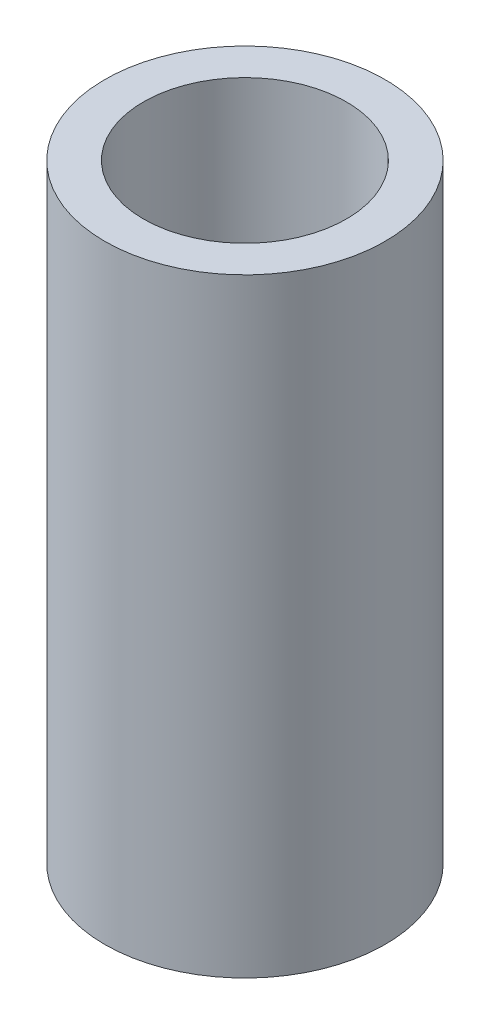
ISO-10303-21;
HEADER;
FILE_DESCRIPTION(('STEP AP214'),'2;1');
FILE_NAME('part.step','',(''),(''),'','','');
FILE_SCHEMA(('AUTOMOTIVE_DESIGN { 1 0 10303 214 1 1 1 1 }'));
ENDSEC;
DATA;
#1=APPLICATION_CONTEXT('core data for automotive mechanical design processes');
#2=APPLICATION_PROTOCOL_DEFINITION('international standard','automotive_design',2000,#1);
#3=PRODUCT_CONTEXT('',#1,'mechanical');
#4=PRODUCT('Part','Part','',(#3));
#5=PRODUCT_RELATED_PRODUCT_CATEGORY('part','',(#4));
#6=PRODUCT_DEFINITION_FORMATION('','',#4);
#7=PRODUCT_DEFINITION_CONTEXT('part definition',#1,'design');
#8=PRODUCT_DEFINITION('design','',#6,#7);
#9=PRODUCT_DEFINITION_SHAPE('','',#8);
#10=(LENGTH_UNIT() NAMED_UNIT(*) SI_UNIT(.MILLI.,.METRE.));
#11=(NAMED_UNIT(*) PLANE_ANGLE_UNIT() SI_UNIT($,.RADIAN.));
#12=(NAMED_UNIT(*) SI_UNIT($,.STERADIAN.) SOLID_ANGLE_UNIT());
#13=UNCERTAINTY_MEASURE_WITH_UNIT(LENGTH_MEASURE(1.E-05),#10,'distance_accuracy_value','');
#14=(GEOMETRIC_REPRESENTATION_CONTEXT(3) GLOBAL_UNCERTAINTY_ASSIGNED_CONTEXT((#13)) GLOBAL_UNIT_ASSIGNED_CONTEXT((#10,
#11,#12)) REPRESENTATION_CONTEXT('',''));
#15=CARTESIAN_POINT('',(0.,0.,0.));
#16=DIRECTION('',(0.,0.,1.));
#17=DIRECTION('',(1.,0.,0.));
#18=AXIS2_PLACEMENT_3D('',#15,#16,#17);
#19=CARTESIAN_POINT('',(0.,63.,0.));
#20=DIRECTION('',(0.,1.,0.));
#21=DIRECTION('',(0.,0.,1.));
#22=AXIS2_PLACEMENT_3D('',#19,#20,#21);
#23=PLANE('',#22);
#24=CARTESIAN_POINT('',(0.,63.,0.));
#25=DIRECTION('',(0.,1.,0.));
#26=DIRECTION('',(0.,0.,1.));
#27=AXIS2_PLACEMENT_3D('',#24,#25,#26);
#28=CIRCLE('',#27,29.);
#29=CARTESIAN_POINT('',(0.,63.,29.));
#30=VERTEX_POINT('',#29);
#31=EDGE_CURVE('E10',#30,#30,#28,.T.);
#32=ORIENTED_EDGE('',*,*,#31,.T.);
#33=EDGE_LOOP('',(#32));
#34=FACE_BOUND('',#33,.T.);
#35=CARTESIAN_POINT('',(0.,63.,0.));
#36=DIRECTION('',(0.,1.,0.));
#37=DIRECTION('',(0.,0.,1.));
#38=AXIS2_PLACEMENT_3D('',#35,#36,#37);
#39=CIRCLE('',#38,21.);
#40=CARTESIAN_POINT('',(0.,63.,21.));
#41=VERTEX_POINT('',#40);
#42=EDGE_CURVE('E42',#41,#41,#39,.T.);
#43=ORIENTED_EDGE('',*,*,#42,.F.);
#44=EDGE_LOOP('',(#43));
#45=FACE_BOUND('',#44,.T.);
#46=ADVANCED_FACE('F31',(#34,#45),#23,.T.);
#47=CARTESIAN_POINT('',(0.,-63.,0.));
#48=DIRECTION('',(0.,1.,0.));
#49=DIRECTION('',(0.,0.,1.));
#50=AXIS2_PLACEMENT_3D('',#47,#48,#49);
#51=PLANE('',#50);
#52=CARTESIAN_POINT('',(0.,-63.,0.));
#53=DIRECTION('',(0.,1.,0.));
#54=DIRECTION('',(0.,0.,1.));
#55=AXIS2_PLACEMENT_3D('',#52,#53,#54);
#56=CIRCLE('',#55,29.);
#57=CARTESIAN_POINT('',(0.,-63.,29.));
#58=VERTEX_POINT('',#57);
#59=EDGE_CURVE('E35',#58,#58,#56,.T.);
#60=ORIENTED_EDGE('',*,*,#59,.F.);
#61=EDGE_LOOP('',(#60));
#62=FACE_BOUND('',#61,.T.);
#63=CARTESIAN_POINT('',(0.,-63.,0.));
#64=DIRECTION('',(0.,1.,0.));
#65=DIRECTION('',(0.,0.,1.));
#66=AXIS2_PLACEMENT_3D('',#63,#64,#65);
#67=CIRCLE('',#66,21.);
#68=CARTESIAN_POINT('',(0.,-63.,21.));
#69=VERTEX_POINT('',#68);
#70=EDGE_CURVE('E44',#69,#69,#67,.T.);
#71=ORIENTED_EDGE('',*,*,#70,.T.);
#72=EDGE_LOOP('',(#71));
#73=FACE_BOUND('',#72,.T.);
#74=ADVANCED_FACE('F54',(#62,#73),#51,.F.);
#75=CARTESIAN_POINT('',(0.,63.,0.));
#76=DIRECTION('',(0.,-1.,0.));
#77=DIRECTION('',(0.,0.,-1.));
#78=AXIS2_PLACEMENT_3D('',#75,#76,#77);
#79=CYLINDRICAL_SURFACE('',#78,29.);
#80=ORIENTED_EDGE('',*,*,#31,.F.);
#81=EDGE_LOOP('',(#80));
#82=FACE_BOUND('',#81,.T.);
#83=ORIENTED_EDGE('',*,*,#59,.T.);
#84=EDGE_LOOP('',(#83));
#85=FACE_BOUND('',#84,.T.);
#86=ADVANCED_FACE('F33',(#82,#85),#79,.T.);
#87=CARTESIAN_POINT('',(0.,63.,0.));
#88=DIRECTION('',(0.,-1.,0.));
#89=DIRECTION('',(0.,0.,-1.));
#90=AXIS2_PLACEMENT_3D('',#87,#88,#89);
#91=CYLINDRICAL_SURFACE('',#90,21.);
#92=ORIENTED_EDGE('',*,*,#42,.T.);
#93=EDGE_LOOP('',(#92));
#94=FACE_BOUND('',#93,.T.);
#95=ORIENTED_EDGE('',*,*,#70,.F.);
#96=EDGE_LOOP('',(#95));
#97=FACE_BOUND('',#96,.T.);
#98=ADVANCED_FACE('F50',(#94,#97),#91,.F.);
#99=CLOSED_SHELL('',(#46,#74,#86,#98));
#100=MANIFOLD_SOLID_BREP('B2',#99);
#101=ADVANCED_BREP_SHAPE_REPRESENTATION('',(#18,#100),#14);
#102=SHAPE_DEFINITION_REPRESENTATION(#9,#101);
ENDSEC;
END-ISO-10303-21;
